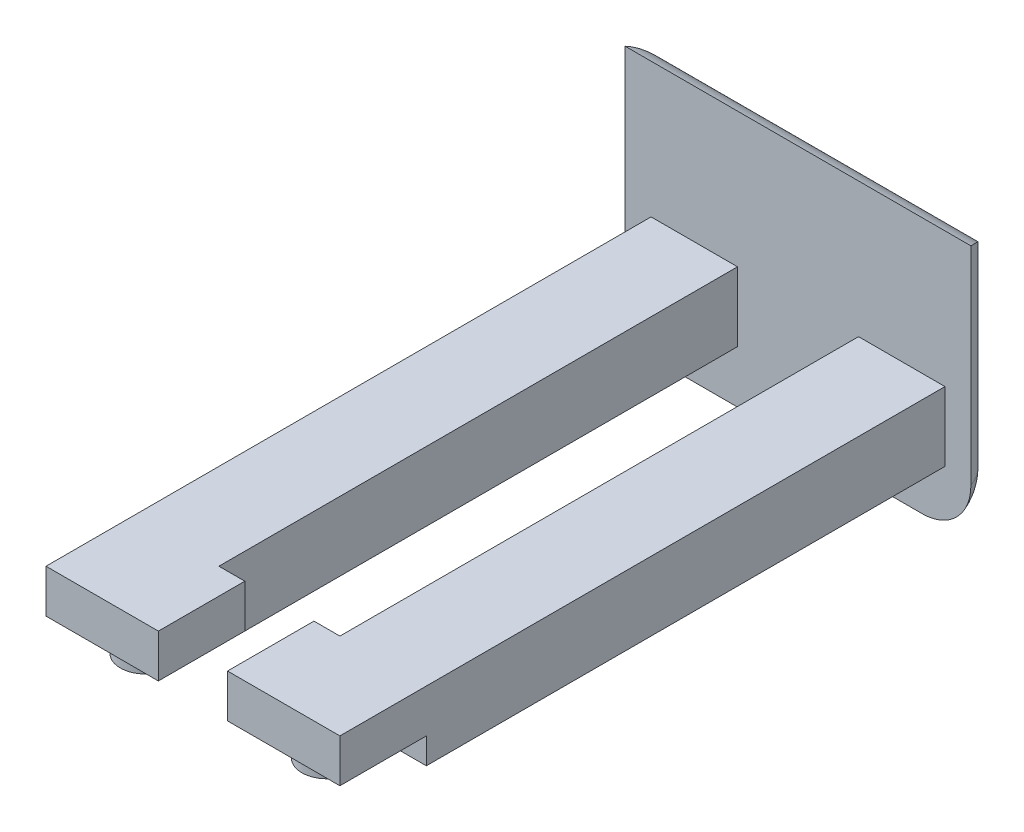
ISO-10303-21;
HEADER;
FILE_DESCRIPTION(('STEP AP214'),'2;1');
FILE_NAME('part.step','',(''),(''),'','','');
FILE_SCHEMA(('AUTOMOTIVE_DESIGN { 1 0 10303 214 1 1 1 1 }'));
ENDSEC;
DATA;
#1=APPLICATION_CONTEXT('core data for automotive mechanical design processes');
#2=APPLICATION_PROTOCOL_DEFINITION('international standard','automotive_design',2000,#1);
#3=PRODUCT_CONTEXT('',#1,'mechanical');
#4=PRODUCT('Part','Part','',(#3));
#5=PRODUCT_RELATED_PRODUCT_CATEGORY('part','',(#4));
#6=PRODUCT_DEFINITION_FORMATION('','',#4);
#7=PRODUCT_DEFINITION_CONTEXT('part definition',#1,'design');
#8=PRODUCT_DEFINITION('design','',#6,#7);
#9=PRODUCT_DEFINITION_SHAPE('','',#8);
#10=(LENGTH_UNIT() NAMED_UNIT(*) SI_UNIT(.MILLI.,.METRE.));
#11=(NAMED_UNIT(*) PLANE_ANGLE_UNIT() SI_UNIT($,.RADIAN.));
#12=(NAMED_UNIT(*) SI_UNIT($,.STERADIAN.) SOLID_ANGLE_UNIT());
#13=UNCERTAINTY_MEASURE_WITH_UNIT(LENGTH_MEASURE(1.E-05),#10,'distance_accuracy_value','');
#14=(GEOMETRIC_REPRESENTATION_CONTEXT(3) GLOBAL_UNCERTAINTY_ASSIGNED_CONTEXT((#13)) GLOBAL_UNIT_ASSIGNED_CONTEXT((#10,
#11,#12)) REPRESENTATION_CONTEXT('',''));
#15=CARTESIAN_POINT('',(0.,0.,0.));
#16=DIRECTION('',(0.,0.,1.));
#17=DIRECTION('',(1.,0.,0.));
#18=AXIS2_PLACEMENT_3D('',#15,#16,#17);
#19=CARTESIAN_POINT('',(-5.07999999999999,-0.762000000000002,93.98));
#20=DIRECTION('',(-1.,0.,0.));
#21=DIRECTION('',(0.,-1.,0.));
#22=AXIS2_PLACEMENT_3D('',#19,#20,#21);
#23=PLANE('',#22);
#24=DIRECTION('',(0.,0.,1.));
#25=VECTOR('',#24,1.);
#26=CARTESIAN_POINT('',(-5.07999999999999,-7.112,81.28));
#27=LINE('',#26,#25);
#28=CARTESIAN_POINT('',(-5.07999999999999,-7.112,81.28));
#29=VERTEX_POINT('',#28);
#30=CARTESIAN_POINT('',(-5.07999999999999,-7.112,93.98));
#31=VERTEX_POINT('',#30);
#32=EDGE_CURVE('E181',#29,#31,#27,.T.);
#33=ORIENTED_EDGE('',*,*,#32,.F.);
#34=DIRECTION('',(0.,1.,0.));
#35=VECTOR('',#34,1.);
#36=CARTESIAN_POINT('',(-5.07999999999999,-0.762000000000002,81.28));
#37=LINE('',#36,#35);
#38=CARTESIAN_POINT('',(-5.07999999999999,-0.762000000000002,81.28));
#39=VERTEX_POINT('',#38);
#40=EDGE_CURVE('E213',#29,#39,#37,.T.);
#41=ORIENTED_EDGE('',*,*,#40,.T.);
#42=DIRECTION('',(0.,0.,-1.));
#43=VECTOR('',#42,1.);
#44=CARTESIAN_POINT('',(-5.07999999999999,-0.762000000000002,93.98));
#45=LINE('',#44,#43);
#46=CARTESIAN_POINT('',(-5.07999999999999,-0.762000000000002,93.98));
#47=VERTEX_POINT('',#46);
#48=EDGE_CURVE('E204',#47,#39,#45,.T.);
#49=ORIENTED_EDGE('',*,*,#48,.F.);
#50=DIRECTION('',(0.,1.,0.));
#51=VECTOR('',#50,1.);
#52=CARTESIAN_POINT('',(-5.07999999999999,-0.762000000000002,93.98));
#53=LINE('',#52,#51);
#54=EDGE_CURVE('E197',#31,#47,#53,.T.);
#55=ORIENTED_EDGE('',*,*,#54,.F.);
#56=EDGE_LOOP('',(#33,#41,#49,#55));
#57=FACE_BOUND('',#56,.T.);
#58=ADVANCED_FACE('F43',(#57),#23,.F.);
#59=CARTESIAN_POINT('',(0.,0.,93.98));
#60=DIRECTION('',(0.,0.,1.));
#61=DIRECTION('',(1.,0.,0.));
#62=AXIS2_PLACEMENT_3D('',#59,#60,#61);
#63=PLANE('',#62);
#64=DIRECTION('',(0.,-1.,0.));
#65=VECTOR('',#64,1.);
#66=CARTESIAN_POINT('',(-21.59,-0.762000000000002,93.98));
#67=LINE('',#66,#65);
#68=CARTESIAN_POINT('',(-21.59,-0.762000000000002,93.98));
#69=VERTEX_POINT('',#68);
#70=CARTESIAN_POINT('',(-21.59,-7.112,93.98));
#71=VERTEX_POINT('',#70);
#72=EDGE_CURVE('E200',#69,#71,#67,.T.);
#73=ORIENTED_EDGE('',*,*,#72,.T.);
#74=DIRECTION('',(-1.,0.,0.));
#75=VECTOR('',#74,1.);
#76=CARTESIAN_POINT('',(-5.07999999999999,-7.112,93.98));
#77=LINE('',#76,#75);
#78=EDGE_CURVE('E184',#31,#71,#77,.T.);
#79=ORIENTED_EDGE('',*,*,#78,.F.);
#80=ORIENTED_EDGE('',*,*,#54,.T.);
#81=DIRECTION('',(-1.,0.,0.));
#82=VECTOR('',#81,1.);
#83=CARTESIAN_POINT('',(-21.59,-0.762000000000002,93.98));
#84=LINE('',#83,#82);
#85=EDGE_CURVE('E206',#47,#69,#84,.T.);
#86=ORIENTED_EDGE('',*,*,#85,.T.);
#87=EDGE_LOOP('',(#73,#79,#80,#86));
#88=FACE_BOUND('',#87,.T.);
#89=ADVANCED_FACE('F195',(#88),#63,.T.);
#90=CARTESIAN_POINT('',(0.,0.,81.28));
#91=DIRECTION('',(0.,0.,1.));
#92=DIRECTION('',(1.,0.,0.));
#93=AXIS2_PLACEMENT_3D('',#90,#91,#92);
#94=PLANE('',#93);
#95=DIRECTION('',(1.,0.,0.));
#96=VECTOR('',#95,1.);
#97=CARTESIAN_POINT('',(0.,-7.112,81.28));
#98=LINE('',#97,#96);
#99=CARTESIAN_POINT('',(-8.89,-7.112,81.28));
#100=VERTEX_POINT('',#99);
#101=EDGE_CURVE('E187',#100,#29,#98,.T.);
#102=ORIENTED_EDGE('',*,*,#101,.F.);
#103=DIRECTION('',(0.,-1.,0.));
#104=VECTOR('',#103,1.);
#105=CARTESIAN_POINT('',(-8.89,-0.762000000000003,81.28));
#106=LINE('',#105,#104);
#107=CARTESIAN_POINT('',(-8.89,-0.762000000000002,81.28));
#108=VERTEX_POINT('',#107);
#109=EDGE_CURVE('E224',#108,#100,#106,.T.);
#110=ORIENTED_EDGE('',*,*,#109,.F.);
#111=DIRECTION('',(-1.,0.,0.));
#112=VECTOR('',#111,1.);
#113=CARTESIAN_POINT('',(-21.59,-0.762000000000002,81.28));
#114=LINE('',#113,#112);
#115=EDGE_CURVE('E209',#39,#108,#114,.T.);
#116=ORIENTED_EDGE('',*,*,#115,.F.);
#117=ORIENTED_EDGE('',*,*,#40,.F.);
#118=EDGE_LOOP('',(#102,#110,#116,#117));
#119=FACE_BOUND('',#118,.T.);
#120=ADVANCED_FACE('F411',(#119),#94,.F.);
#121=CARTESIAN_POINT('',(0.,0.,5.08));
#122=DIRECTION('',(0.,0.,1.));
#123=DIRECTION('',(1.,0.,0.));
#124=AXIS2_PLACEMENT_3D('',#121,#122,#123);
#125=PLANE('',#124);
#126=DIRECTION('',(0.,-1.,0.));
#127=VECTOR('',#126,1.);
#128=CARTESIAN_POINT('',(-25.4,-19.05,5.08));
#129=LINE('',#128,#127);
#130=CARTESIAN_POINT('',(-25.4,19.05,5.08));
#131=VERTEX_POINT('',#130);
#132=CARTESIAN_POINT('',(-25.4,-11.43,5.08));
#133=VERTEX_POINT('',#132);
#134=EDGE_CURVE('E269',#131,#133,#129,.T.);
#135=ORIENTED_EDGE('',*,*,#134,.T.);
#136=CARTESIAN_POINT('',(-18.2157951031447,-11.43,5.08));
#137=DIRECTION('',(0.,0.,1.));
#138=DIRECTION('',(1.,0.,0.));
#139=AXIS2_PLACEMENT_3D('',#136,#137,#138);
#140=CIRCLE('',#139,7.18420489685532);
#141=CARTESIAN_POINT('',(-18.2157951031447,-18.6142048968553,5.08));
#142=VERTEX_POINT('',#141);
#143=EDGE_CURVE('E298',#133,#142,#140,.T.);
#144=ORIENTED_EDGE('',*,*,#143,.T.);
#145=DIRECTION('',(1.,0.,0.));
#146=VECTOR('',#145,1.);
#147=CARTESIAN_POINT('',(0.,-18.6142048968553,5.08));
#148=LINE('',#147,#146);
#149=CARTESIAN_POINT('',(18.2157951031447,-18.6142048968553,5.08));
#150=VERTEX_POINT('',#149);
#151=EDGE_CURVE('E67',#142,#150,#148,.T.);
#152=ORIENTED_EDGE('',*,*,#151,.T.);
#153=CARTESIAN_POINT('',(18.2157951031447,-11.43,5.08));
#154=DIRECTION('',(0.,0.,1.));
#155=DIRECTION('',(1.,0.,0.));
#156=AXIS2_PLACEMENT_3D('',#153,#154,#155);
#157=CIRCLE('',#156,7.18420489685532);
#158=CARTESIAN_POINT('',(25.4,-11.43,5.08));
#159=VERTEX_POINT('',#158);
#160=EDGE_CURVE('E296',#150,#159,#157,.T.);
#161=ORIENTED_EDGE('',*,*,#160,.T.);
#162=DIRECTION('',(0.,1.,0.));
#163=VECTOR('',#162,1.);
#164=CARTESIAN_POINT('',(25.4,-19.05,5.08));
#165=LINE('',#164,#163);
#166=CARTESIAN_POINT('',(25.4,19.05,5.08));
#167=VERTEX_POINT('',#166);
#168=EDGE_CURVE('E272',#159,#167,#165,.T.);
#169=ORIENTED_EDGE('',*,*,#168,.T.);
#170=DIRECTION('',(-1.,0.,0.));
#171=VECTOR('',#170,1.);
#172=CARTESIAN_POINT('',(25.4,19.05,5.08));
#173=LINE('',#172,#171);
#174=EDGE_CURVE('E274',#167,#131,#173,.T.);
#175=ORIENTED_EDGE('',*,*,#174,.T.);
#176=EDGE_LOOP('',(#135,#144,#152,#161,#169,#175));
#177=FACE_BOUND('',#176,.T.);
#178=DIRECTION('',(0.,1.,0.));
#179=VECTOR('',#178,1.);
#180=CARTESIAN_POINT('',(-8.89,-0.762000000000003,5.08));
#181=LINE('',#180,#179);
#182=CARTESIAN_POINT('',(-8.89,-10.922,5.08));
#183=VERTEX_POINT('',#182);
#184=CARTESIAN_POINT('',(-8.89,-0.762000000000003,5.08));
#185=VERTEX_POINT('',#184);
#186=EDGE_CURVE('E220',#183,#185,#181,.T.);
#187=ORIENTED_EDGE('',*,*,#186,.F.);
#188=DIRECTION('',(1.,0.,0.));
#189=VECTOR('',#188,1.);
#190=CARTESIAN_POINT('',(-21.59,-10.922,5.08));
#191=LINE('',#190,#189);
#192=CARTESIAN_POINT('',(-21.59,-10.922,5.08));
#193=VERTEX_POINT('',#192);
#194=EDGE_CURVE('E259',#193,#183,#191,.T.);
#195=ORIENTED_EDGE('',*,*,#194,.F.);
#196=DIRECTION('',(0.,-1.,0.));
#197=VECTOR('',#196,1.);
#198=CARTESIAN_POINT('',(-21.59,-0.762000000000002,5.08));
#199=LINE('',#198,#197);
#200=CARTESIAN_POINT('',(-21.59,-0.762000000000002,5.08));
#201=VERTEX_POINT('',#200);
#202=EDGE_CURVE('E256',#201,#193,#199,.T.);
#203=ORIENTED_EDGE('',*,*,#202,.F.);
#204=DIRECTION('',(-1.,0.,0.));
#205=VECTOR('',#204,1.);
#206=CARTESIAN_POINT('',(-21.59,-0.762000000000002,5.08));
#207=LINE('',#206,#205);
#208=EDGE_CURVE('E262',#185,#201,#207,.T.);
#209=ORIENTED_EDGE('',*,*,#208,.F.);
#210=EDGE_LOOP('',(#187,#195,#203,#209));
#211=FACE_BOUND('',#210,.T.);
#212=DIRECTION('',(1.,0.,0.));
#213=VECTOR('',#212,1.);
#214=CARTESIAN_POINT('',(5.08,-10.922,5.08));
#215=LINE('',#214,#213);
#216=CARTESIAN_POINT('',(8.89,-10.922,5.08));
#217=VERTEX_POINT('',#216);
#218=CARTESIAN_POINT('',(21.59,-10.922,5.08));
#219=VERTEX_POINT('',#218);
#220=EDGE_CURVE('E222',#217,#219,#215,.T.);
#221=ORIENTED_EDGE('',*,*,#220,.F.);
#222=DIRECTION('',(0.,-1.,0.));
#223=VECTOR('',#222,1.);
#224=CARTESIAN_POINT('',(8.89,-0.762000000000002,5.08));
#225=LINE('',#224,#223);
#226=CARTESIAN_POINT('',(8.89,-0.762000000000002,5.08));
#227=VERTEX_POINT('',#226);
#228=EDGE_CURVE('E233',#227,#217,#225,.T.);
#229=ORIENTED_EDGE('',*,*,#228,.F.);
#230=DIRECTION('',(-1.,0.,0.));
#231=VECTOR('',#230,1.);
#232=CARTESIAN_POINT('',(5.08,-0.762000000000002,5.08));
#233=LINE('',#232,#231);
#234=CARTESIAN_POINT('',(21.59,-0.762000000000002,5.08));
#235=VERTEX_POINT('',#234);
#236=EDGE_CURVE('E249',#235,#227,#233,.T.);
#237=ORIENTED_EDGE('',*,*,#236,.F.);
#238=DIRECTION('',(0.,1.,0.));
#239=VECTOR('',#238,1.);
#240=CARTESIAN_POINT('',(21.59,-0.762000000000002,5.08));
#241=LINE('',#240,#239);
#242=EDGE_CURVE('E246',#219,#235,#241,.T.);
#243=ORIENTED_EDGE('',*,*,#242,.F.);
#244=EDGE_LOOP('',(#221,#229,#237,#243));
#245=FACE_BOUND('',#244,.T.);
#246=ADVANCED_FACE('F384',(#177,#211,#245),#125,.T.);
#247=CARTESIAN_POINT('',(0.,0.,0.));
#248=DIRECTION('',(0.,0.,1.));
#249=DIRECTION('',(1.,0.,0.));
#250=AXIS2_PLACEMENT_3D('',#247,#248,#249);
#251=PLANE('',#250);
#252=DIRECTION('',(0.,1.,0.));
#253=VECTOR('',#252,1.);
#254=CARTESIAN_POINT('',(18.2157951031447,0.,0.));
#255=LINE('',#254,#253);
#256=CARTESIAN_POINT('',(18.2157951031447,11.8657951031447,0.));
#257=VERTEX_POINT('',#256);
#258=CARTESIAN_POINT('',(18.2157951031447,-11.43,0.));
#259=VERTEX_POINT('',#258);
#260=EDGE_CURVE('E284',#257,#259,#255,.F.);
#261=ORIENTED_EDGE('',*,*,#260,.T.);
#262=DIRECTION('',(1.,0.,0.));
#263=VECTOR('',#262,1.);
#264=CARTESIAN_POINT('',(0.,-11.43,0.));
#265=LINE('',#264,#263);
#266=CARTESIAN_POINT('',(-18.2157951031447,-11.43,0.));
#267=VERTEX_POINT('',#266);
#268=EDGE_CURVE('E11',#259,#267,#265,.F.);
#269=ORIENTED_EDGE('',*,*,#268,.T.);
#270=DIRECTION('',(0.,-1.,0.));
#271=VECTOR('',#270,1.);
#272=CARTESIAN_POINT('',(-18.2157951031447,0.,0.));
#273=LINE('',#272,#271);
#274=CARTESIAN_POINT('',(-18.2157951031447,11.8657951031447,0.));
#275=VERTEX_POINT('',#274);
#276=EDGE_CURVE('E286',#267,#275,#273,.F.);
#277=ORIENTED_EDGE('',*,*,#276,.T.);
#278=DIRECTION('',(-1.,0.,0.));
#279=VECTOR('',#278,1.);
#280=CARTESIAN_POINT('',(0.,11.8657951031447,0.));
#281=LINE('',#280,#279);
#282=EDGE_CURVE('E281',#275,#257,#281,.F.);
#283=ORIENTED_EDGE('',*,*,#282,.T.);
#284=EDGE_LOOP('',(#261,#269,#277,#283));
#285=FACE_BOUND('',#284,.T.);
#286=ADVANCED_FACE('F657',(#285),#251,.F.);
#287=CARTESIAN_POINT('',(-21.59,-0.762000000000002,81.28));
#288=DIRECTION('',(1.,0.,0.));
#289=DIRECTION('',(0.,0.,-1.));
#290=AXIS2_PLACEMENT_3D('',#287,#288,#289);
#291=PLANE('',#290);
#292=DIRECTION('',(0.,0.,-1.));
#293=VECTOR('',#292,1.);
#294=CARTESIAN_POINT('',(-21.59,-10.922,81.28));
#295=LINE('',#294,#293);
#296=CARTESIAN_POINT('',(-21.59,-10.922,81.28));
#297=VERTEX_POINT('',#296);
#298=EDGE_CURVE('E267',#297,#193,#295,.T.);
#299=ORIENTED_EDGE('',*,*,#298,.F.);
#300=DIRECTION('',(0.,-1.,0.));
#301=VECTOR('',#300,1.);
#302=CARTESIAN_POINT('',(-21.59,-7.112,81.28));
#303=LINE('',#302,#301);
#304=CARTESIAN_POINT('',(-21.59,-7.112,81.28));
#305=VERTEX_POINT('',#304);
#306=EDGE_CURVE('E325',#305,#297,#303,.T.);
#307=ORIENTED_EDGE('',*,*,#306,.F.);
#308=DIRECTION('',(0.,0.,-1.));
#309=VECTOR('',#308,1.);
#310=CARTESIAN_POINT('',(-21.59,-7.112,81.28));
#311=LINE('',#310,#309);
#312=EDGE_CURVE('E201',#71,#305,#311,.T.);
#313=ORIENTED_EDGE('',*,*,#312,.F.);
#314=ORIENTED_EDGE('',*,*,#72,.F.);
#315=DIRECTION('',(0.,0.,-1.));
#316=VECTOR('',#315,1.);
#317=CARTESIAN_POINT('',(-21.59,-0.762000000000002,81.28));
#318=LINE('',#317,#316);
#319=EDGE_CURVE('E264',#69,#201,#318,.T.);
#320=ORIENTED_EDGE('',*,*,#319,.T.);
#321=ORIENTED_EDGE('',*,*,#202,.T.);
#322=EDGE_LOOP('',(#299,#307,#313,#314,#320,#321));
#323=FACE_BOUND('',#322,.T.);
#324=ADVANCED_FACE('F647',(#323),#291,.F.);
#325=CARTESIAN_POINT('',(-21.59,-10.922,81.28));
#326=DIRECTION('',(0.,1.,0.));
#327=DIRECTION('',(0.,0.,1.));
#328=AXIS2_PLACEMENT_3D('',#325,#326,#327);
#329=PLANE('',#328);
#330=DIRECTION('',(0.,0.,1.));
#331=VECTOR('',#330,1.);
#332=CARTESIAN_POINT('',(-8.89,-10.922,-5.77088475655327));
#333=LINE('',#332,#331);
#334=CARTESIAN_POINT('',(-8.89,-10.922,81.28));
#335=VERTEX_POINT('',#334);
#336=EDGE_CURVE('E223',#183,#335,#333,.T.);
#337=ORIENTED_EDGE('',*,*,#336,.T.);
#338=DIRECTION('',(1.,0.,0.));
#339=VECTOR('',#338,1.);
#340=CARTESIAN_POINT('',(-5.07999999999999,-10.922,81.28));
#341=LINE('',#340,#339);
#342=EDGE_CURVE('E191',#297,#335,#341,.T.);
#343=ORIENTED_EDGE('',*,*,#342,.F.);
#344=ORIENTED_EDGE('',*,*,#298,.T.);
#345=ORIENTED_EDGE('',*,*,#194,.T.);
#346=EDGE_LOOP('',(#337,#343,#344,#345));
#347=FACE_BOUND('',#346,.T.);
#348=ADVANCED_FACE('F402',(#347),#329,.F.);
#349=CARTESIAN_POINT('',(-21.59,-0.762000000000002,81.28));
#350=DIRECTION('',(0.,-1.,0.));
#351=DIRECTION('',(0.,0.,-1.));
#352=AXIS2_PLACEMENT_3D('',#349,#350,#351);
#353=PLANE('',#352);
#354=ORIENTED_EDGE('',*,*,#319,.F.);
#355=ORIENTED_EDGE('',*,*,#85,.F.);
#356=ORIENTED_EDGE('',*,*,#48,.T.);
#357=ORIENTED_EDGE('',*,*,#115,.T.);
#358=DIRECTION('',(0.,0.,1.));
#359=VECTOR('',#358,1.);
#360=CARTESIAN_POINT('',(-8.89,-0.762000000000003,-5.77088475655327));
#361=LINE('',#360,#359);
#362=EDGE_CURVE('E227',#185,#108,#361,.T.);
#363=ORIENTED_EDGE('',*,*,#362,.F.);
#364=ORIENTED_EDGE('',*,*,#208,.T.);
#365=EDGE_LOOP('',(#354,#355,#356,#357,#363,#364));
#366=FACE_BOUND('',#365,.T.);
#367=ADVANCED_FACE('F395',(#366),#353,.F.);
#368=CARTESIAN_POINT('',(5.08,-10.922,81.28));
#369=DIRECTION('',(0.,1.,0.));
#370=DIRECTION('',(0.,0.,1.));
#371=AXIS2_PLACEMENT_3D('',#368,#369,#370);
#372=PLANE('',#371);
#373=DIRECTION('',(0.,0.,-1.));
#374=VECTOR('',#373,1.);
#375=CARTESIAN_POINT('',(21.59,-10.922,81.28));
#376=LINE('',#375,#374);
#377=CARTESIAN_POINT('',(21.59,-10.922,81.28));
#378=VERTEX_POINT('',#377);
#379=EDGE_CURVE('E254',#378,#219,#376,.T.);
#380=ORIENTED_EDGE('',*,*,#379,.F.);
#381=DIRECTION('',(1.,0.,0.));
#382=VECTOR('',#381,1.);
#383=CARTESIAN_POINT('',(5.07999999999999,-10.922,81.28));
#384=LINE('',#383,#382);
#385=CARTESIAN_POINT('',(8.89,-10.922,81.28));
#386=VERTEX_POINT('',#385);
#387=EDGE_CURVE('E320',#386,#378,#384,.T.);
#388=ORIENTED_EDGE('',*,*,#387,.F.);
#389=DIRECTION('',(0.,0.,1.));
#390=VECTOR('',#389,1.);
#391=CARTESIAN_POINT('',(8.89,-10.922,-5.77088475655327));
#392=LINE('',#391,#390);
#393=EDGE_CURVE('E239',#217,#386,#392,.T.);
#394=ORIENTED_EDGE('',*,*,#393,.F.);
#395=ORIENTED_EDGE('',*,*,#220,.T.);
#396=EDGE_LOOP('',(#380,#388,#394,#395));
#397=FACE_BOUND('',#396,.T.);
#398=ADVANCED_FACE('F393',(#397),#372,.F.);
#399=CARTESIAN_POINT('',(21.59,-0.762000000000002,81.28));
#400=DIRECTION('',(-1.,0.,0.));
#401=DIRECTION('',(0.,0.,1.));
#402=AXIS2_PLACEMENT_3D('',#399,#400,#401);
#403=PLANE('',#402);
#404=DIRECTION('',(0.,0.,1.));
#405=VECTOR('',#404,1.);
#406=CARTESIAN_POINT('',(21.59,-7.112,81.28));
#407=LINE('',#406,#405);
#408=CARTESIAN_POINT('',(21.59,-7.112,81.28));
#409=VERTEX_POINT('',#408);
#410=CARTESIAN_POINT('',(21.59,-7.112,93.98));
#411=VERTEX_POINT('',#410);
#412=EDGE_CURVE('E336',#409,#411,#407,.T.);
#413=ORIENTED_EDGE('',*,*,#412,.F.);
#414=DIRECTION('',(0.,-1.,0.));
#415=VECTOR('',#414,1.);
#416=CARTESIAN_POINT('',(21.59,-7.112,81.28));
#417=LINE('',#416,#415);
#418=EDGE_CURVE('E327',#409,#378,#417,.T.);
#419=ORIENTED_EDGE('',*,*,#418,.T.);
#420=ORIENTED_EDGE('',*,*,#379,.T.);
#421=ORIENTED_EDGE('',*,*,#242,.T.);
#422=DIRECTION('',(0.,0.,-1.));
#423=VECTOR('',#422,1.);
#424=CARTESIAN_POINT('',(21.59,-0.762000000000002,81.28));
#425=LINE('',#424,#423);
#426=CARTESIAN_POINT('',(21.59,-0.762000000000002,93.98));
#427=VERTEX_POINT('',#426);
#428=EDGE_CURVE('E252',#427,#235,#425,.T.);
#429=ORIENTED_EDGE('',*,*,#428,.F.);
#430=DIRECTION('',(0.,1.,0.));
#431=VECTOR('',#430,1.);
#432=CARTESIAN_POINT('',(21.59,-0.762000000000002,93.98));
#433=LINE('',#432,#431);
#434=EDGE_CURVE('E343',#411,#427,#433,.T.);
#435=ORIENTED_EDGE('',*,*,#434,.F.);
#436=EDGE_LOOP('',(#413,#419,#420,#421,#429,#435));
#437=FACE_BOUND('',#436,.T.);
#438=ADVANCED_FACE('F380',(#437),#403,.F.);
#439=CARTESIAN_POINT('',(5.08,-0.762000000000002,81.28));
#440=DIRECTION('',(0.,-1.,0.));
#441=DIRECTION('',(0.,0.,-1.));
#442=AXIS2_PLACEMENT_3D('',#439,#440,#441);
#443=PLANE('',#442);
#444=ORIENTED_EDGE('',*,*,#236,.T.);
#445=DIRECTION('',(0.,0.,1.));
#446=VECTOR('',#445,1.);
#447=CARTESIAN_POINT('',(8.89,-0.762000000000002,-5.77088475655327));
#448=LINE('',#447,#446);
#449=CARTESIAN_POINT('',(8.89,-0.762000000000002,81.28));
#450=VERTEX_POINT('',#449);
#451=EDGE_CURVE('E235',#227,#450,#448,.T.);
#452=ORIENTED_EDGE('',*,*,#451,.T.);
#453=DIRECTION('',(-1.,0.,0.));
#454=VECTOR('',#453,1.);
#455=CARTESIAN_POINT('',(21.59,-0.762000000000002,81.28));
#456=LINE('',#455,#454);
#457=CARTESIAN_POINT('',(5.07999999999999,-0.762000000000004,81.28));
#458=VERTEX_POINT('',#457);
#459=EDGE_CURVE('E329',#450,#458,#456,.T.);
#460=ORIENTED_EDGE('',*,*,#459,.T.);
#461=DIRECTION('',(0.,0.,-1.));
#462=VECTOR('',#461,1.);
#463=CARTESIAN_POINT('',(5.07999999999999,-0.762000000000004,93.98));
#464=LINE('',#463,#462);
#465=CARTESIAN_POINT('',(5.07999999999999,-0.762000000000004,93.98));
#466=VERTEX_POINT('',#465);
#467=EDGE_CURVE('E215',#466,#458,#464,.T.);
#468=ORIENTED_EDGE('',*,*,#467,.F.);
#469=DIRECTION('',(-1.,0.,0.));
#470=VECTOR('',#469,1.);
#471=CARTESIAN_POINT('',(21.59,-0.762000000000002,93.98));
#472=LINE('',#471,#470);
#473=EDGE_CURVE('E345',#427,#466,#472,.T.);
#474=ORIENTED_EDGE('',*,*,#473,.F.);
#475=ORIENTED_EDGE('',*,*,#428,.T.);
#476=EDGE_LOOP('',(#444,#452,#460,#468,#474,#475));
#477=FACE_BOUND('',#476,.T.);
#478=ADVANCED_FACE('F375',(#477),#443,.F.);
#479=CARTESIAN_POINT('',(8.89,-0.762000000000002,-5.77088475655327));
#480=DIRECTION('',(1.,0.,0.));
#481=DIRECTION('',(0.,1.,0.));
#482=AXIS2_PLACEMENT_3D('',#479,#480,#481);
#483=PLANE('',#482);
#484=ORIENTED_EDGE('',*,*,#228,.T.);
#485=ORIENTED_EDGE('',*,*,#393,.T.);
#486=DIRECTION('',(0.,1.,0.));
#487=VECTOR('',#486,1.);
#488=CARTESIAN_POINT('',(8.89,-0.762000000000002,81.28));
#489=LINE('',#488,#487);
#490=CARTESIAN_POINT('',(8.89,-7.112,81.28));
#491=VERTEX_POINT('',#490);
#492=EDGE_CURVE('E236',#386,#491,#489,.T.);
#493=ORIENTED_EDGE('',*,*,#492,.T.);
#494=EDGE_CURVE('E219',#491,#450,#489,.T.);
#495=ORIENTED_EDGE('',*,*,#494,.T.);
#496=ORIENTED_EDGE('',*,*,#451,.F.);
#497=EDGE_LOOP('',(#484,#485,#493,#495,#496));
#498=FACE_BOUND('',#497,.T.);
#499=ADVANCED_FACE('F388',(#498),#483,.F.);
#500=CARTESIAN_POINT('',(-8.89,-0.762000000000003,-5.77088475655327));
#501=DIRECTION('',(-1.,0.,0.));
#502=DIRECTION('',(0.,-1.,0.));
#503=AXIS2_PLACEMENT_3D('',#500,#501,#502);
#504=PLANE('',#503);
#505=ORIENTED_EDGE('',*,*,#186,.T.);
#506=ORIENTED_EDGE('',*,*,#362,.T.);
#507=ORIENTED_EDGE('',*,*,#109,.T.);
#508=EDGE_CURVE('E228',#100,#335,#106,.T.);
#509=ORIENTED_EDGE('',*,*,#508,.T.);
#510=ORIENTED_EDGE('',*,*,#336,.F.);
#511=EDGE_LOOP('',(#505,#506,#507,#509,#510));
#512=FACE_BOUND('',#511,.T.);
#513=ADVANCED_FACE('F415',(#512),#504,.F.);
#514=CARTESIAN_POINT('',(0.,0.,81.28));
#515=DIRECTION('',(0.,0.,-1.));
#516=DIRECTION('',(-1.,0.,0.));
#517=AXIS2_PLACEMENT_3D('',#514,#515,#516);
#518=PLANE('',#517);
#519=DIRECTION('',(1.,0.,0.));
#520=VECTOR('',#519,1.);
#521=CARTESIAN_POINT('',(5.07999999999999,-7.112,81.28));
#522=LINE('',#521,#520);
#523=CARTESIAN_POINT('',(5.07999999999999,-7.112,81.28));
#524=VERTEX_POINT('',#523);
#525=EDGE_CURVE('E333',#524,#491,#522,.T.);
#526=ORIENTED_EDGE('',*,*,#525,.F.);
#527=DIRECTION('',(0.,-1.,0.));
#528=VECTOR('',#527,1.);
#529=CARTESIAN_POINT('',(5.07999999999999,-0.762000000000004,81.28));
#530=LINE('',#529,#528);
#531=EDGE_CURVE('E346',#458,#524,#530,.T.);
#532=ORIENTED_EDGE('',*,*,#531,.F.);
#533=ORIENTED_EDGE('',*,*,#459,.F.);
#534=ORIENTED_EDGE('',*,*,#494,.F.);
#535=EDGE_LOOP('',(#526,#532,#533,#534));
#536=FACE_BOUND('',#535,.T.);
#537=ADVANCED_FACE('F365',(#536),#518,.T.);
#538=CARTESIAN_POINT('',(5.07999999999999,-0.762000000000004,93.98));
#539=DIRECTION('',(1.,0.,0.));
#540=DIRECTION('',(0.,1.,0.));
#541=AXIS2_PLACEMENT_3D('',#538,#539,#540);
#542=PLANE('',#541);
#543=ORIENTED_EDGE('',*,*,#531,.T.);
#544=DIRECTION('',(0.,0.,-1.));
#545=VECTOR('',#544,1.);
#546=CARTESIAN_POINT('',(5.07999999999999,-7.112,81.28));
#547=LINE('',#546,#545);
#548=CARTESIAN_POINT('',(5.07999999999999,-7.112,93.98));
#549=VERTEX_POINT('',#548);
#550=EDGE_CURVE('E330',#549,#524,#547,.T.);
#551=ORIENTED_EDGE('',*,*,#550,.F.);
#552=DIRECTION('',(0.,-1.,0.));
#553=VECTOR('',#552,1.);
#554=CARTESIAN_POINT('',(5.07999999999999,-0.762000000000004,93.98));
#555=LINE('',#554,#553);
#556=EDGE_CURVE('E348',#466,#549,#555,.T.);
#557=ORIENTED_EDGE('',*,*,#556,.F.);
#558=ORIENTED_EDGE('',*,*,#467,.T.);
#559=EDGE_LOOP('',(#543,#551,#557,#558));
#560=FACE_BOUND('',#559,.T.);
#561=ADVANCED_FACE('F358',(#560),#542,.F.);
#562=CARTESIAN_POINT('',(0.,0.,93.98));
#563=DIRECTION('',(0.,0.,-1.));
#564=DIRECTION('',(-1.,0.,0.));
#565=AXIS2_PLACEMENT_3D('',#562,#563,#564);
#566=PLANE('',#565);
#567=ORIENTED_EDGE('',*,*,#556,.T.);
#568=DIRECTION('',(-1.,0.,0.));
#569=VECTOR('',#568,1.);
#570=CARTESIAN_POINT('',(5.07999999999999,-7.112,93.98));
#571=LINE('',#570,#569);
#572=EDGE_CURVE('E338',#411,#549,#571,.T.);
#573=ORIENTED_EDGE('',*,*,#572,.F.);
#574=ORIENTED_EDGE('',*,*,#434,.T.);
#575=ORIENTED_EDGE('',*,*,#473,.T.);
#576=EDGE_LOOP('',(#567,#573,#574,#575));
#577=FACE_BOUND('',#576,.T.);
#578=ADVANCED_FACE('F372',(#577),#566,.F.);
#579=CARTESIAN_POINT('',(5.07999999999999,-7.112,81.28));
#580=DIRECTION('',(0.,0.,-1.));
#581=DIRECTION('',(-1.,0.,0.));
#582=AXIS2_PLACEMENT_3D('',#579,#580,#581);
#583=PLANE('',#582);
#584=ORIENTED_EDGE('',*,*,#387,.T.);
#585=ORIENTED_EDGE('',*,*,#418,.F.);
#586=EDGE_CURVE('E332',#491,#409,#522,.T.);
#587=ORIENTED_EDGE('',*,*,#586,.F.);
#588=ORIENTED_EDGE('',*,*,#492,.F.);
#589=EDGE_LOOP('',(#584,#585,#587,#588));
#590=FACE_BOUND('',#589,.T.);
#591=ADVANCED_FACE('F391',(#590),#583,.F.);
#592=CARTESIAN_POINT('',(0.,-7.112,0.));
#593=DIRECTION('',(0.,1.,0.));
#594=DIRECTION('',(0.,0.,1.));
#595=AXIS2_PLACEMENT_3D('',#592,#593,#594);
#596=PLANE('',#595);
#597=CARTESIAN_POINT('',(13.335,-7.112,87.63));
#598=DIRECTION('',(0.,-1.,0.));
#599=DIRECTION('',(0.,0.,-1.));
#600=AXIS2_PLACEMENT_3D('',#597,#598,#599);
#601=CIRCLE('',#600,3.683);
#602=CARTESIAN_POINT('',(13.335,-7.112,83.947));
#603=VERTEX_POINT('',#602);
#604=EDGE_CURVE('E311',#603,#603,#601,.T.);
#605=ORIENTED_EDGE('',*,*,#604,.F.);
#606=EDGE_LOOP('',(#605));
#607=FACE_BOUND('',#606,.T.);
#608=ORIENTED_EDGE('',*,*,#550,.T.);
#609=ORIENTED_EDGE('',*,*,#525,.T.);
#610=ORIENTED_EDGE('',*,*,#586,.T.);
#611=ORIENTED_EDGE('',*,*,#412,.T.);
#612=ORIENTED_EDGE('',*,*,#572,.T.);
#613=EDGE_LOOP('',(#608,#609,#610,#611,#612));
#614=FACE_BOUND('',#613,.T.);
#615=ADVANCED_FACE('F368',(#607,#614),#596,.F.);
#616=CARTESIAN_POINT('',(-5.07999999999999,-7.112,81.28));
#617=DIRECTION('',(0.,0.,-1.));
#618=DIRECTION('',(-1.,0.,0.));
#619=AXIS2_PLACEMENT_3D('',#616,#617,#618);
#620=PLANE('',#619);
#621=DIRECTION('',(1.,0.,0.));
#622=VECTOR('',#621,1.);
#623=CARTESIAN_POINT('',(-5.07999999999999,-7.112,81.28));
#624=LINE('',#623,#622);
#625=EDGE_CURVE('E323',#305,#100,#624,.T.);
#626=ORIENTED_EDGE('',*,*,#625,.F.);
#627=ORIENTED_EDGE('',*,*,#306,.T.);
#628=ORIENTED_EDGE('',*,*,#342,.T.);
#629=ORIENTED_EDGE('',*,*,#508,.F.);
#630=EDGE_LOOP('',(#626,#627,#628,#629));
#631=FACE_BOUND('',#630,.T.);
#632=ADVANCED_FACE('F466',(#631),#620,.F.);
#633=CARTESIAN_POINT('',(0.,-7.112,0.));
#634=DIRECTION('',(0.,-1.,0.));
#635=DIRECTION('',(0.,0.,-1.));
#636=AXIS2_PLACEMENT_3D('',#633,#634,#635);
#637=PLANE('',#636);
#638=CARTESIAN_POINT('',(-13.335,-7.112,87.63));
#639=DIRECTION('',(0.,-1.,0.));
#640=DIRECTION('',(0.,0.,-1.));
#641=AXIS2_PLACEMENT_3D('',#638,#639,#640);
#642=CIRCLE('',#641,3.683);
#643=CARTESIAN_POINT('',(-13.335,-7.112,83.947));
#644=VERTEX_POINT('',#643);
#645=EDGE_CURVE('E278',#644,#644,#642,.T.);
#646=ORIENTED_EDGE('',*,*,#645,.F.);
#647=EDGE_LOOP('',(#646));
#648=FACE_BOUND('',#647,.T.);
#649=ORIENTED_EDGE('',*,*,#32,.T.);
#650=ORIENTED_EDGE('',*,*,#78,.T.);
#651=ORIENTED_EDGE('',*,*,#312,.T.);
#652=ORIENTED_EDGE('',*,*,#625,.T.);
#653=ORIENTED_EDGE('',*,*,#101,.T.);
#654=EDGE_LOOP('',(#649,#650,#651,#652,#653));
#655=FACE_BOUND('',#654,.T.);
#656=ADVANCED_FACE('F183',(#648,#655),#637,.T.);
#657=CARTESIAN_POINT('',(-13.335,-7.112,87.63));
#658=DIRECTION('',(0.,-1.,0.));
#659=DIRECTION('',(0.,0.,-1.));
#660=AXIS2_PLACEMENT_3D('',#657,#658,#659);
#661=CYLINDRICAL_SURFACE('',#660,3.683);
#662=CARTESIAN_POINT('',(-13.335,-10.922,87.63));
#663=DIRECTION('',(0.,-1.,0.));
#664=DIRECTION('',(0.,0.,-1.));
#665=AXIS2_PLACEMENT_3D('',#662,#663,#664);
#666=CIRCLE('',#665,3.683);
#667=CARTESIAN_POINT('',(-13.335,-10.922,83.947));
#668=VERTEX_POINT('',#667);
#669=EDGE_CURVE('E316',#668,#668,#666,.T.);
#670=CARTESIAN_POINT('',(-13.335,-7.112,83.947));
#671=CARTESIAN_POINT('',(-13.335,-7.1516875,83.947));
#672=CARTESIAN_POINT('',(-13.335,-7.191375,83.947));
#673=CARTESIAN_POINT('',(-13.335,-7.27075,83.947));
#674=CARTESIAN_POINT('',(-13.335,-7.3104375,83.947));
#675=CARTESIAN_POINT('',(-13.335,-7.3898125,83.947));
#676=CARTESIAN_POINT('',(-13.335,-7.4295,83.947));
#677=CARTESIAN_POINT('',(-13.335,-7.508875,83.947));
#678=CARTESIAN_POINT('',(-13.335,-7.5485625,83.947));
#679=CARTESIAN_POINT('',(-13.335,-7.6279375,83.947));
#680=CARTESIAN_POINT('',(-13.335,-7.667625,83.947));
#681=CARTESIAN_POINT('',(-13.335,-7.747,83.947));
#682=CARTESIAN_POINT('',(-13.335,-7.7866875,83.947));
#683=CARTESIAN_POINT('',(-13.335,-7.8660625,83.947));
#684=CARTESIAN_POINT('',(-13.335,-7.90575,83.947));
#685=CARTESIAN_POINT('',(-13.335,-7.985125,83.947));
#686=CARTESIAN_POINT('',(-13.335,-8.0248125,83.947));
#687=CARTESIAN_POINT('',(-13.335,-8.1041875,83.947));
#688=CARTESIAN_POINT('',(-13.335,-8.143875,83.947));
#689=CARTESIAN_POINT('',(-13.335,-8.22325,83.947));
#690=CARTESIAN_POINT('',(-13.335,-8.2629375,83.947));
#691=CARTESIAN_POINT('',(-13.335,-8.3423125,83.947));
#692=CARTESIAN_POINT('',(-13.335,-8.382,83.947));
#693=CARTESIAN_POINT('',(-13.335,-8.461375,83.947));
#694=CARTESIAN_POINT('',(-13.335,-8.5010625,83.947));
#695=CARTESIAN_POINT('',(-13.335,-8.5804375,83.947));
#696=CARTESIAN_POINT('',(-13.335,-8.620125,83.947));
#697=CARTESIAN_POINT('',(-13.335,-8.6995,83.947));
#698=CARTESIAN_POINT('',(-13.335,-8.7391875,83.947));
#699=CARTESIAN_POINT('',(-13.335,-8.8185625,83.947));
#700=CARTESIAN_POINT('',(-13.335,-8.85825,83.947));
#701=CARTESIAN_POINT('',(-13.335,-8.937625,83.947));
#702=CARTESIAN_POINT('',(-13.335,-8.9773125,83.947));
#703=CARTESIAN_POINT('',(-13.335,-9.0566875,83.947));
#704=CARTESIAN_POINT('',(-13.335,-9.096375,83.947));
#705=CARTESIAN_POINT('',(-13.335,-9.17575,83.947));
#706=CARTESIAN_POINT('',(-13.335,-9.2154375,83.947));
#707=CARTESIAN_POINT('',(-13.335,-9.2948125,83.947));
#708=CARTESIAN_POINT('',(-13.335,-9.3345,83.947));
#709=CARTESIAN_POINT('',(-13.335,-9.413875,83.947));
#710=CARTESIAN_POINT('',(-13.335,-9.4535625,83.947));
#711=CARTESIAN_POINT('',(-13.335,-9.5329375,83.947));
#712=CARTESIAN_POINT('',(-13.335,-9.572625,83.947));
#713=CARTESIAN_POINT('',(-13.335,-9.652,83.947));
#714=CARTESIAN_POINT('',(-13.335,-9.6916875,83.947));
#715=CARTESIAN_POINT('',(-13.335,-9.7710625,83.947));
#716=CARTESIAN_POINT('',(-13.335,-9.81075,83.947));
#717=CARTESIAN_POINT('',(-13.335,-9.890125,83.947));
#718=CARTESIAN_POINT('',(-13.335,-9.9298125,83.947));
#719=CARTESIAN_POINT('',(-13.335,-10.0091875,83.947));
#720=CARTESIAN_POINT('',(-13.335,-10.048875,83.947));
#721=CARTESIAN_POINT('',(-13.335,-10.12825,83.947));
#722=CARTESIAN_POINT('',(-13.335,-10.1679375,83.947));
#723=CARTESIAN_POINT('',(-13.335,-10.2473125,83.947));
#724=CARTESIAN_POINT('',(-13.335,-10.287,83.947));
#725=CARTESIAN_POINT('',(-13.335,-10.366375,83.947));
#726=CARTESIAN_POINT('',(-13.335,-10.4060625,83.947));
#727=CARTESIAN_POINT('',(-13.335,-10.4854375,83.947));
#728=CARTESIAN_POINT('',(-13.335,-10.525125,83.947));
#729=CARTESIAN_POINT('',(-13.335,-10.6045,83.947));
#730=CARTESIAN_POINT('',(-13.335,-10.6441875,83.947));
#731=CARTESIAN_POINT('',(-13.335,-10.7235625,83.947));
#732=CARTESIAN_POINT('',(-13.335,-10.76325,83.947));
#733=CARTESIAN_POINT('',(-13.335,-10.842625,83.947));
#734=CARTESIAN_POINT('',(-13.335,-10.8823125,83.947));
#735=CARTESIAN_POINT('',(-13.335,-10.922,83.947));
#736=B_SPLINE_CURVE_WITH_KNOTS('',3,(#670,#671,#672,#673,#674,#675,#676,#677,#678,#679,#680,
#681,#682,#683,#684,#685,#686,#687,#688,#689,#690,#691,#692,#693,#694,#695,#696,#697,#698,#699,
#700,#701,#702,#703,#704,#705,#706,#707,#708,#709,#710,#711,#712,#713,#714,#715,#716,#717,#718,
#719,#720,#721,#722,#723,#724,#725,#726,#727,#728,#729,#730,#731,#732,#733,#734,#735),
.UNSPECIFIED.,.F.,.F.,(4,2,2,2,2,2,2,2,2,2,2,2,2,2,2,2,2,2,2,2,2,2,2,2,2,2,2,2,2,2,2,2,4),(0.,
0.119062499999999,0.238125,0.3571875,0.476249999999999,0.595312499999999,0.714375,
0.833437499999999,0.952499999999998,1.0715625,1.190625,1.3096875,1.42875,1.5478125,1.666875,
1.7859375,1.905,2.0240625,2.143125,2.2621875,2.38125,2.5003125,2.619375,2.7384375,2.8575,
2.9765625,3.095625,3.2146875,3.33375,3.4528125,3.571875,3.6909375,3.81),.UNSPECIFIED.);
#737=EDGE_CURVE('BSEAM480',#644,#668,#736,.T.);
#738=ORIENTED_EDGE('',*,*,#645,.T.);
#739=ORIENTED_EDGE('',*,*,#669,.F.);
#740=ORIENTED_EDGE('',*,*,#737,.T.);
#741=ORIENTED_EDGE('',*,*,#737,.F.);
#742=EDGE_LOOP('',(#738,#740,#739,#741));
#743=FACE_BOUND('',#742,.T.);
#744=ADVANCED_FACE('F480',(#743),#661,.T.);
#745=CARTESIAN_POINT('',(-13.335,-10.922,87.63));
#746=DIRECTION('',(0.,-1.,0.));
#747=DIRECTION('',(0.,0.,-1.));
#748=AXIS2_PLACEMENT_3D('',#745,#746,#747);
#749=PLANE('',#748);
#750=ORIENTED_EDGE('',*,*,#669,.T.);
#751=EDGE_LOOP('',(#750));
#752=FACE_BOUND('',#751,.T.);
#753=ADVANCED_FACE('F488',(#752),#749,.T.);
#754=CARTESIAN_POINT('',(13.335,-7.112,87.63));
#755=DIRECTION('',(0.,-1.,0.));
#756=DIRECTION('',(0.,0.,-1.));
#757=AXIS2_PLACEMENT_3D('',#754,#755,#756);
#758=CYLINDRICAL_SURFACE('',#757,3.683);
#759=CARTESIAN_POINT('',(13.335,-10.922,87.63));
#760=DIRECTION('',(0.,-1.,0.));
#761=DIRECTION('',(0.,0.,-1.));
#762=AXIS2_PLACEMENT_3D('',#759,#760,#761);
#763=CIRCLE('',#762,3.683);
#764=CARTESIAN_POINT('',(13.335,-10.922,83.947));
#765=VERTEX_POINT('',#764);
#766=EDGE_CURVE('E306',#765,#765,#763,.T.);
#767=CARTESIAN_POINT('',(13.335,-7.112,83.947));
#768=CARTESIAN_POINT('',(13.335,-7.1516875,83.947));
#769=CARTESIAN_POINT('',(13.335,-7.191375,83.947));
#770=CARTESIAN_POINT('',(13.335,-7.27075,83.947));
#771=CARTESIAN_POINT('',(13.335,-7.3104375,83.947));
#772=CARTESIAN_POINT('',(13.335,-7.3898125,83.947));
#773=CARTESIAN_POINT('',(13.335,-7.4295,83.947));
#774=CARTESIAN_POINT('',(13.335,-7.508875,83.947));
#775=CARTESIAN_POINT('',(13.335,-7.5485625,83.947));
#776=CARTESIAN_POINT('',(13.335,-7.6279375,83.947));
#777=CARTESIAN_POINT('',(13.335,-7.667625,83.947));
#778=CARTESIAN_POINT('',(13.335,-7.747,83.947));
#779=CARTESIAN_POINT('',(13.335,-7.7866875,83.947));
#780=CARTESIAN_POINT('',(13.335,-7.8660625,83.947));
#781=CARTESIAN_POINT('',(13.335,-7.90575,83.947));
#782=CARTESIAN_POINT('',(13.335,-7.985125,83.947));
#783=CARTESIAN_POINT('',(13.335,-8.0248125,83.947));
#784=CARTESIAN_POINT('',(13.335,-8.1041875,83.947));
#785=CARTESIAN_POINT('',(13.335,-8.143875,83.947));
#786=CARTESIAN_POINT('',(13.335,-8.22325,83.947));
#787=CARTESIAN_POINT('',(13.335,-8.2629375,83.947));
#788=CARTESIAN_POINT('',(13.335,-8.3423125,83.947));
#789=CARTESIAN_POINT('',(13.335,-8.382,83.947));
#790=CARTESIAN_POINT('',(13.335,-8.461375,83.947));
#791=CARTESIAN_POINT('',(13.335,-8.5010625,83.947));
#792=CARTESIAN_POINT('',(13.335,-8.5804375,83.947));
#793=CARTESIAN_POINT('',(13.335,-8.620125,83.947));
#794=CARTESIAN_POINT('',(13.335,-8.6995,83.947));
#795=CARTESIAN_POINT('',(13.335,-8.7391875,83.947));
#796=CARTESIAN_POINT('',(13.335,-8.8185625,83.947));
#797=CARTESIAN_POINT('',(13.335,-8.85825,83.947));
#798=CARTESIAN_POINT('',(13.335,-8.937625,83.947));
#799=CARTESIAN_POINT('',(13.335,-8.9773125,83.947));
#800=CARTESIAN_POINT('',(13.335,-9.0566875,83.947));
#801=CARTESIAN_POINT('',(13.335,-9.096375,83.947));
#802=CARTESIAN_POINT('',(13.335,-9.17575,83.947));
#803=CARTESIAN_POINT('',(13.335,-9.2154375,83.947));
#804=CARTESIAN_POINT('',(13.335,-9.2948125,83.947));
#805=CARTESIAN_POINT('',(13.335,-9.3345,83.947));
#806=CARTESIAN_POINT('',(13.335,-9.413875,83.947));
#807=CARTESIAN_POINT('',(13.335,-9.4535625,83.947));
#808=CARTESIAN_POINT('',(13.335,-9.5329375,83.947));
#809=CARTESIAN_POINT('',(13.335,-9.572625,83.947));
#810=CARTESIAN_POINT('',(13.335,-9.652,83.947));
#811=CARTESIAN_POINT('',(13.335,-9.6916875,83.947));
#812=CARTESIAN_POINT('',(13.335,-9.7710625,83.947));
#813=CARTESIAN_POINT('',(13.335,-9.81075,83.947));
#814=CARTESIAN_POINT('',(13.335,-9.890125,83.947));
#815=CARTESIAN_POINT('',(13.335,-9.9298125,83.947));
#816=CARTESIAN_POINT('',(13.335,-10.0091875,83.947));
#817=CARTESIAN_POINT('',(13.335,-10.048875,83.947));
#818=CARTESIAN_POINT('',(13.335,-10.12825,83.947));
#819=CARTESIAN_POINT('',(13.335,-10.1679375,83.947));
#820=CARTESIAN_POINT('',(13.335,-10.2473125,83.947));
#821=CARTESIAN_POINT('',(13.335,-10.287,83.947));
#822=CARTESIAN_POINT('',(13.335,-10.366375,83.947));
#823=CARTESIAN_POINT('',(13.335,-10.4060625,83.947));
#824=CARTESIAN_POINT('',(13.335,-10.4854375,83.947));
#825=CARTESIAN_POINT('',(13.335,-10.525125,83.947));
#826=CARTESIAN_POINT('',(13.335,-10.6045,83.947));
#827=CARTESIAN_POINT('',(13.335,-10.6441875,83.947));
#828=CARTESIAN_POINT('',(13.335,-10.7235625,83.947));
#829=CARTESIAN_POINT('',(13.335,-10.76325,83.947));
#830=CARTESIAN_POINT('',(13.335,-10.842625,83.947));
#831=CARTESIAN_POINT('',(13.335,-10.8823125,83.947));
#832=CARTESIAN_POINT('',(13.335,-10.922,83.947));
#833=B_SPLINE_CURVE_WITH_KNOTS('',3,(#767,#768,#769,#770,#771,#772,#773,#774,#775,#776,#777,
#778,#779,#780,#781,#782,#783,#784,#785,#786,#787,#788,#789,#790,#791,#792,#793,#794,#795,#796,
#797,#798,#799,#800,#801,#802,#803,#804,#805,#806,#807,#808,#809,#810,#811,#812,#813,#814,#815,
#816,#817,#818,#819,#820,#821,#822,#823,#824,#825,#826,#827,#828,#829,#830,#831,#832),
.UNSPECIFIED.,.F.,.F.,(4,2,2,2,2,2,2,2,2,2,2,2,2,2,2,2,2,2,2,2,2,2,2,2,2,2,2,2,2,2,2,2,4),(0.,
0.119062499999999,0.238125,0.3571875,0.476249999999999,0.595312499999999,0.714375,
0.833437499999999,0.952499999999998,1.0715625,1.190625,1.3096875,1.42875,1.5478125,1.666875,
1.7859375,1.905,2.0240625,2.143125,2.2621875,2.38125,2.5003125,2.619375,2.7384375,2.8575,
2.9765625,3.095625,3.2146875,3.33375,3.4528125,3.571875,3.6909375,3.81),.UNSPECIFIED.);
#834=EDGE_CURVE('BSEAM496',#603,#765,#833,.T.);
#835=ORIENTED_EDGE('',*,*,#604,.T.);
#836=ORIENTED_EDGE('',*,*,#766,.F.);
#837=ORIENTED_EDGE('',*,*,#834,.T.);
#838=ORIENTED_EDGE('',*,*,#834,.F.);
#839=EDGE_LOOP('',(#835,#837,#836,#838));
#840=FACE_BOUND('',#839,.T.);
#841=ADVANCED_FACE('F496',(#840),#758,.T.);
#842=CARTESIAN_POINT('',(13.335,-10.922,87.63));
#843=DIRECTION('',(0.,-1.,0.));
#844=DIRECTION('',(0.,0.,-1.));
#845=AXIS2_PLACEMENT_3D('',#842,#843,#844);
#846=PLANE('',#845);
#847=ORIENTED_EDGE('',*,*,#766,.T.);
#848=EDGE_LOOP('',(#847));
#849=FACE_BOUND('',#848,.T.);
#850=ADVANCED_FACE('F504',(#849),#846,.T.);
#851=CARTESIAN_POINT('',(25.4,11.8657951031447,7.62));
#852=DIRECTION('',(-1.,0.,0.));
#853=DIRECTION('',(0.,-1.,0.));
#854=AXIS2_PLACEMENT_3D('',#851,#852,#853);
#855=CYLINDRICAL_SURFACE('',#854,7.62);
#856=ORIENTED_EDGE('',*,*,#282,.F.);
#857=CARTESIAN_POINT('',(-18.2157951031447,11.8657951031447,7.62));
#858=DIRECTION('',(-0.707106781186547,-0.707106781186548,0.));
#859=DIRECTION('',(-0.707106781186548,0.707106781186547,0.));
#860=AXIS2_PLACEMENT_3D('',#857,#858,#859);
#861=ELLIPSE('',#860,10.776307345283,7.62);
#862=EDGE_CURVE('E290',#275,#131,#861,.F.);
#863=ORIENTED_EDGE('',*,*,#862,.T.);
#864=ORIENTED_EDGE('',*,*,#174,.F.);
#865=CARTESIAN_POINT('',(18.2157951031447,11.8657951031447,7.62));
#866=DIRECTION('',(-0.707106781186548,0.707106781186547,0.));
#867=DIRECTION('',(-0.707106781186547,-0.707106781186548,0.));
#868=AXIS2_PLACEMENT_3D('',#865,#866,#867);
#869=ELLIPSE('',#868,10.776307345283,7.62);
#870=EDGE_CURVE('E288',#167,#257,#869,.T.);
#871=ORIENTED_EDGE('',*,*,#870,.T.);
#872=EDGE_LOOP('',(#856,#863,#864,#871));
#873=FACE_BOUND('',#872,.T.);
#874=ADVANCED_FACE('F512',(#873),#855,.T.);
#875=CARTESIAN_POINT('',(-18.2157951031447,-19.05,7.62));
#876=DIRECTION('',(0.,-1.,0.));
#877=DIRECTION('',(0.,0.,-1.));
#878=AXIS2_PLACEMENT_3D('',#875,#876,#877);
#879=CYLINDRICAL_SURFACE('',#878,7.62);
#880=ORIENTED_EDGE('',*,*,#276,.F.);
#881=CARTESIAN_POINT('',(-18.2157951031447,-11.43,7.62));
#882=DIRECTION('',(0.,-1.,0.));
#883=DIRECTION('',(0.,0.,-1.));
#884=AXIS2_PLACEMENT_3D('',#881,#882,#883);
#885=CIRCLE('',#884,7.62);
#886=EDGE_CURVE('E292',#267,#133,#885,.F.);
#887=ORIENTED_EDGE('',*,*,#886,.T.);
#888=ORIENTED_EDGE('',*,*,#134,.F.);
#889=ORIENTED_EDGE('',*,*,#862,.F.);
#890=EDGE_LOOP('',(#880,#887,#888,#889));
#891=FACE_BOUND('',#890,.T.);
#892=ADVANCED_FACE('F519',(#891),#879,.T.);
#893=CARTESIAN_POINT('',(18.2157951031447,-19.05,7.62));
#894=DIRECTION('',(0.,1.,0.));
#895=DIRECTION('',(0.,0.,1.));
#896=AXIS2_PLACEMENT_3D('',#893,#894,#895);
#897=CYLINDRICAL_SURFACE('',#896,7.62);
#898=ORIENTED_EDGE('',*,*,#168,.F.);
#899=CARTESIAN_POINT('',(18.2157951031447,-11.43,7.62));
#900=DIRECTION('',(0.,1.,0.));
#901=DIRECTION('',(0.,0.,1.));
#902=AXIS2_PLACEMENT_3D('',#899,#900,#901);
#903=CIRCLE('',#902,7.62);
#904=EDGE_CURVE('E52',#159,#259,#903,.T.);
#905=ORIENTED_EDGE('',*,*,#904,.T.);
#906=ORIENTED_EDGE('',*,*,#260,.F.);
#907=ORIENTED_EDGE('',*,*,#870,.F.);
#908=EDGE_LOOP('',(#898,#905,#906,#907));
#909=FACE_BOUND('',#908,.T.);
#910=ADVANCED_FACE('F528',(#909),#897,.T.);
#911=CARTESIAN_POINT('',(18.2157951031447,-11.43,7.62));
#912=DIRECTION('',(0.,1.,0.));
#913=DIRECTION('',(-1.,0.,0.));
#914=AXIS2_PLACEMENT_3D('',#911,#912,#913);
#915=SPHERICAL_SURFACE('',#914,7.62);
#916=ORIENTED_EDGE('',*,*,#904,.F.);
#917=ORIENTED_EDGE('',*,*,#160,.F.);
#918=CARTESIAN_POINT('',(18.2157951031447,-11.43,7.62));
#919=DIRECTION('',(-1.,0.,0.));
#920=DIRECTION('',(0.,0.,1.));
#921=AXIS2_PLACEMENT_3D('',#918,#919,#920);
#922=CIRCLE('',#921,7.62);
#923=EDGE_CURVE('E47',#259,#150,#922,.T.);
#924=ORIENTED_EDGE('',*,*,#923,.F.);
#925=EDGE_LOOP('',(#916,#917,#924));
#926=FACE_BOUND('',#925,.T.);
#927=ADVANCED_FACE('F45',(#926),#915,.T.);
#928=CARTESIAN_POINT('',(25.4,-11.43,7.62));
#929=DIRECTION('',(1.,0.,0.));
#930=DIRECTION('',(0.,1.,0.));
#931=AXIS2_PLACEMENT_3D('',#928,#929,#930);
#932=CYLINDRICAL_SURFACE('',#931,7.62);
#933=ORIENTED_EDGE('',*,*,#923,.T.);
#934=ORIENTED_EDGE('',*,*,#151,.F.);
#935=CARTESIAN_POINT('',(-18.2157951031447,-11.43,7.62));
#936=DIRECTION('',(-1.,0.,0.));
#937=DIRECTION('',(0.,0.,1.));
#938=AXIS2_PLACEMENT_3D('',#935,#936,#937);
#939=CIRCLE('',#938,7.62);
#940=EDGE_CURVE('E300',#267,#142,#939,.T.);
#941=ORIENTED_EDGE('',*,*,#940,.F.);
#942=ORIENTED_EDGE('',*,*,#268,.F.);
#943=EDGE_LOOP('',(#933,#934,#941,#942));
#944=FACE_BOUND('',#943,.T.);
#945=ADVANCED_FACE('F543',(#944),#932,.T.);
#946=CARTESIAN_POINT('',(-18.2157951031447,-11.43,7.62));
#947=DIRECTION('',(0.,1.,0.));
#948=DIRECTION('',(-1.,0.,0.));
#949=AXIS2_PLACEMENT_3D('',#946,#947,#948);
#950=SPHERICAL_SURFACE('',#949,7.62);
#951=ORIENTED_EDGE('',*,*,#143,.F.);
#952=ORIENTED_EDGE('',*,*,#886,.F.);
#953=ORIENTED_EDGE('',*,*,#940,.T.);
#954=EDGE_LOOP('',(#951,#952,#953));
#955=FACE_BOUND('',#954,.T.);
#956=ADVANCED_FACE('F550',(#955),#950,.T.);
#957=CLOSED_SHELL('',(#58,#89,#120,#246,#286,#324,#348,#367,#398,#438,#478,#499,#513,#537,#561,
#578,#591,#615,#632,#656,#744,#753,#841,#850,#874,#892,#910,#927,#945,#956));
#958=MANIFOLD_SOLID_BREP('B2',#957);
#959=ADVANCED_BREP_SHAPE_REPRESENTATION('',(#18,#958),#14);
#960=SHAPE_DEFINITION_REPRESENTATION(#9,#959);
ENDSEC;
END-ISO-10303-21;
